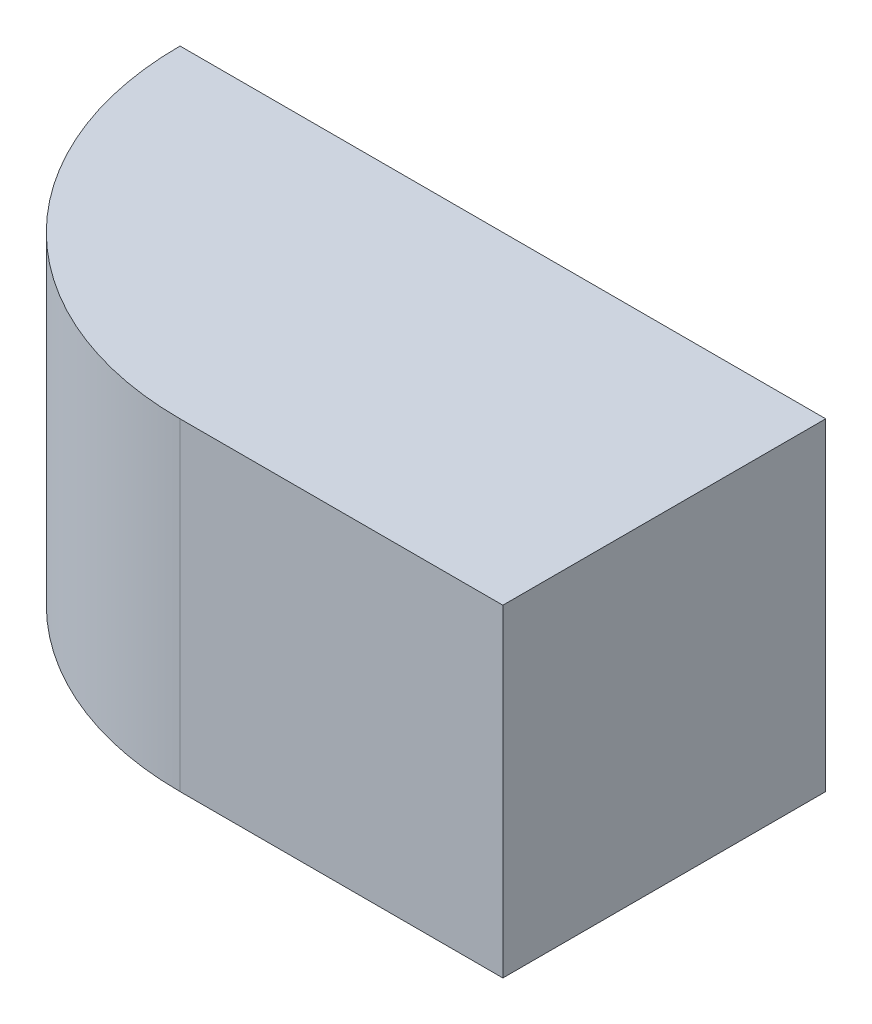
ISO-10303-21;
HEADER;
FILE_DESCRIPTION(('STEP AP214'),'2;1');
FILE_NAME('part.step','',(''),(''),'','','');
FILE_SCHEMA(('AUTOMOTIVE_DESIGN { 1 0 10303 214 1 1 1 1 }'));
ENDSEC;
DATA;
#1=APPLICATION_CONTEXT('core data for automotive mechanical design processes');
#2=APPLICATION_PROTOCOL_DEFINITION('international standard','automotive_design',2000,#1);
#3=PRODUCT_CONTEXT('',#1,'mechanical');
#4=PRODUCT('Part','Part','',(#3));
#5=PRODUCT_RELATED_PRODUCT_CATEGORY('part','',(#4));
#6=PRODUCT_DEFINITION_FORMATION('','',#4);
#7=PRODUCT_DEFINITION_CONTEXT('part definition',#1,'design');
#8=PRODUCT_DEFINITION('design','',#6,#7);
#9=PRODUCT_DEFINITION_SHAPE('','',#8);
#10=(LENGTH_UNIT() NAMED_UNIT(*) SI_UNIT(.MILLI.,.METRE.));
#11=(NAMED_UNIT(*) PLANE_ANGLE_UNIT() SI_UNIT($,.RADIAN.));
#12=(NAMED_UNIT(*) SI_UNIT($,.STERADIAN.) SOLID_ANGLE_UNIT());
#13=UNCERTAINTY_MEASURE_WITH_UNIT(LENGTH_MEASURE(1.E-05),#10,'distance_accuracy_value','');
#14=(GEOMETRIC_REPRESENTATION_CONTEXT(3) GLOBAL_UNCERTAINTY_ASSIGNED_CONTEXT((#13)) GLOBAL_UNIT_ASSIGNED_CONTEXT((#10,
#11,#12)) REPRESENTATION_CONTEXT('',''));
#15=CARTESIAN_POINT('',(0.,0.,0.));
#16=DIRECTION('',(0.,0.,1.));
#17=DIRECTION('',(1.,0.,0.));
#18=AXIS2_PLACEMENT_3D('',#15,#16,#17);
#19=CARTESIAN_POINT('',(-2.00000002980232,-3.75000013038516,2.));
#20=DIRECTION('',(0.,0.,1.));
#21=DIRECTION('',(1.,0.,0.));
#22=AXIS2_PLACEMENT_3D('',#19,#20,#21);
#23=PLANE('',#22);
#24=DIRECTION('',(-1.,0.,0.));
#25=VECTOR('',#24,1.);
#26=CARTESIAN_POINT('',(-1.50000002235174,-4.00000013411045,2.));
#27=LINE('',#26,#25);
#28=CARTESIAN_POINT('',(-1.50000002235174,-4.00000013411045,2.));
#29=VERTEX_POINT('',#28);
#30=CARTESIAN_POINT('',(-2.5000000372529,-4.00000013411045,2.));
#31=VERTEX_POINT('',#30);
#32=EDGE_CURVE('E60',#29,#31,#27,.T.);
#33=ORIENTED_EDGE('',*,*,#32,.T.);
#34=DIRECTION('',(0.,1.,0.));
#35=VECTOR('',#34,1.);
#36=CARTESIAN_POINT('',(-2.5000000372529,-4.00000013411045,2.));
#37=LINE('',#36,#35);
#38=CARTESIAN_POINT('',(-2.5000000372529,-3.50000012665987,2.));
#39=VERTEX_POINT('',#38);
#40=EDGE_CURVE('E91',#31,#39,#37,.T.);
#41=ORIENTED_EDGE('',*,*,#40,.T.);
#42=DIRECTION('',(1.,0.,0.));
#43=VECTOR('',#42,1.);
#44=CARTESIAN_POINT('',(-2.5000000372529,-3.50000012665987,2.));
#45=LINE('',#44,#43);
#46=CARTESIAN_POINT('',(-1.50000002235174,-3.50000012665987,2.));
#47=VERTEX_POINT('',#46);
#48=EDGE_CURVE('E83',#39,#47,#45,.T.);
#49=ORIENTED_EDGE('',*,*,#48,.T.);
#50=DIRECTION('',(0.,-1.,0.));
#51=VECTOR('',#50,1.);
#52=CARTESIAN_POINT('',(-1.50000002235174,-3.50000012665987,2.));
#53=LINE('',#52,#51);
#54=EDGE_CURVE('E27',#47,#29,#53,.T.);
#55=ORIENTED_EDGE('',*,*,#54,.T.);
#56=EDGE_LOOP('',(#33,#41,#49,#55));
#57=FACE_BOUND('',#56,.T.);
#58=ADVANCED_FACE('F17',(#57),#23,.F.);
#59=CARTESIAN_POINT('',(-2.00000002980232,-3.75000013038516,2.5));
#60=DIRECTION('',(0.,0.,1.));
#61=DIRECTION('',(1.,0.,0.));
#62=AXIS2_PLACEMENT_3D('',#59,#60,#61);
#63=PLANE('',#62);
#64=DIRECTION('',(0.,1.,0.));
#65=VECTOR('',#64,1.);
#66=CARTESIAN_POINT('',(-2.0000000372529,-3.62500012852252,2.5));
#67=LINE('',#66,#65);
#68=CARTESIAN_POINT('',(-2.0000000372529,-4.00000013411045,2.5));
#69=VERTEX_POINT('',#68);
#70=CARTESIAN_POINT('',(-2.0000000372529,-3.50000012665987,2.5));
#71=VERTEX_POINT('',#70);
#72=EDGE_CURVE('E96',#69,#71,#67,.T.);
#73=ORIENTED_EDGE('',*,*,#72,.F.);
#74=DIRECTION('',(1.,0.,0.));
#75=VECTOR('',#74,1.);
#76=CARTESIAN_POINT('',(-1.50000002235174,-4.00000013411045,2.5));
#77=LINE('',#76,#75);
#78=CARTESIAN_POINT('',(-1.50000002235174,-4.00000013411045,2.5));
#79=VERTEX_POINT('',#78);
#80=EDGE_CURVE('E70',#69,#79,#77,.T.);
#81=ORIENTED_EDGE('',*,*,#80,.T.);
#82=DIRECTION('',(0.,1.,0.));
#83=VECTOR('',#82,1.);
#84=CARTESIAN_POINT('',(-1.50000002235174,-3.50000012665987,2.5));
#85=LINE('',#84,#83);
#86=CARTESIAN_POINT('',(-1.50000002235174,-3.50000012665987,2.5));
#87=VERTEX_POINT('',#86);
#88=EDGE_CURVE('E11',#79,#87,#85,.T.);
#89=ORIENTED_EDGE('',*,*,#88,.T.);
#90=DIRECTION('',(-1.,0.,0.));
#91=VECTOR('',#90,1.);
#92=CARTESIAN_POINT('',(-2.5000000372529,-3.50000012665987,2.5));
#93=LINE('',#92,#91);
#94=EDGE_CURVE('E76',#87,#71,#93,.T.);
#95=ORIENTED_EDGE('',*,*,#94,.T.);
#96=EDGE_LOOP('',(#73,#81,#89,#95));
#97=FACE_BOUND('',#96,.T.);
#98=ADVANCED_FACE('F19',(#97),#63,.T.);
#99=CARTESIAN_POINT('',(-1.50000002235174,-4.00000013411045,2.));
#100=DIRECTION('',(1.,0.,0.));
#101=DIRECTION('',(0.,1.,0.));
#102=AXIS2_PLACEMENT_3D('',#99,#100,#101);
#103=PLANE('',#102);
#104=ORIENTED_EDGE('',*,*,#54,.F.);
#105=DIRECTION('',(0.,0.,1.));
#106=VECTOR('',#105,1.);
#107=CARTESIAN_POINT('',(-1.50000002235174,-3.50000012665987,2.));
#108=LINE('',#107,#106);
#109=EDGE_CURVE('E88',#47,#87,#108,.T.);
#110=ORIENTED_EDGE('',*,*,#109,.T.);
#111=ORIENTED_EDGE('',*,*,#88,.F.);
#112=DIRECTION('',(0.,0.,1.));
#113=VECTOR('',#112,1.);
#114=CARTESIAN_POINT('',(-1.50000002235174,-4.00000013411045,2.));
#115=LINE('',#114,#113);
#116=EDGE_CURVE('E107',#29,#79,#115,.T.);
#117=ORIENTED_EDGE('',*,*,#116,.F.);
#118=EDGE_LOOP('',(#104,#110,#111,#117));
#119=FACE_BOUND('',#118,.T.);
#120=ADVANCED_FACE('F119',(#119),#103,.T.);
#121=CARTESIAN_POINT('',(-1.50000002235174,-3.50000012665987,2.));
#122=DIRECTION('',(0.,1.,0.));
#123=DIRECTION('',(1.,0.,0.));
#124=AXIS2_PLACEMENT_3D('',#121,#122,#123);
#125=PLANE('',#124);
#126=CARTESIAN_POINT('',(-2.0000000372529,-3.50000012665987,2.));
#127=DIRECTION('',(0.,-1.,0.));
#128=DIRECTION('',(-0.707106781186548,0.,0.707106781186548));
#129=AXIS2_PLACEMENT_3D('',#126,#127,#128);
#130=CIRCLE('',#129,0.5);
#131=EDGE_CURVE('E86',#71,#39,#130,.T.);
#132=ORIENTED_EDGE('',*,*,#131,.F.);
#133=ORIENTED_EDGE('',*,*,#94,.F.);
#134=ORIENTED_EDGE('',*,*,#109,.F.);
#135=ORIENTED_EDGE('',*,*,#48,.F.);
#136=EDGE_LOOP('',(#132,#133,#134,#135));
#137=FACE_BOUND('',#136,.T.);
#138=ADVANCED_FACE('F84',(#137),#125,.T.);
#139=CARTESIAN_POINT('',(-2.5000000372529,-4.00000013411045,2.));
#140=DIRECTION('',(0.,-1.,0.));
#141=DIRECTION('',(0.,0.,-1.));
#142=AXIS2_PLACEMENT_3D('',#139,#140,#141);
#143=PLANE('',#142);
#144=CARTESIAN_POINT('',(-2.0000000372529,-4.00000013411045,2.));
#145=DIRECTION('',(0.,1.,0.));
#146=DIRECTION('',(-0.707106781186548,0.,0.707106781186548));
#147=AXIS2_PLACEMENT_3D('',#144,#145,#146);
#148=CIRCLE('',#147,0.5);
#149=EDGE_CURVE('E103',#31,#69,#148,.T.);
#150=ORIENTED_EDGE('',*,*,#149,.F.);
#151=ORIENTED_EDGE('',*,*,#32,.F.);
#152=ORIENTED_EDGE('',*,*,#116,.T.);
#153=ORIENTED_EDGE('',*,*,#80,.F.);
#154=EDGE_LOOP('',(#150,#151,#152,#153));
#155=FACE_BOUND('',#154,.T.);
#156=ADVANCED_FACE('F120',(#155),#143,.T.);
#157=CARTESIAN_POINT('',(-2.0000000372529,-3.62500012852252,2.));
#158=DIRECTION('',(0.,-1.,0.));
#159=DIRECTION('',(-0.707106781186548,0.,0.707106781186548));
#160=AXIS2_PLACEMENT_3D('',#157,#158,#159);
#161=CYLINDRICAL_SURFACE('',#160,0.5);
#162=ORIENTED_EDGE('',*,*,#149,.T.);
#163=ORIENTED_EDGE('',*,*,#72,.T.);
#164=ORIENTED_EDGE('',*,*,#131,.T.);
#165=ORIENTED_EDGE('',*,*,#40,.F.);
#166=EDGE_LOOP('',(#162,#163,#164,#165));
#167=FACE_BOUND('',#166,.T.);
#168=ADVANCED_FACE('F95',(#167),#161,.T.);
#169=CLOSED_SHELL('',(#58,#98,#120,#138,#156,#168));
#170=MANIFOLD_SOLID_BREP('B1',#169);
#171=ADVANCED_BREP_SHAPE_REPRESENTATION('',(#18,#170),#14);
#172=SHAPE_DEFINITION_REPRESENTATION(#9,#171);
ENDSEC;
END-ISO-10303-21;
